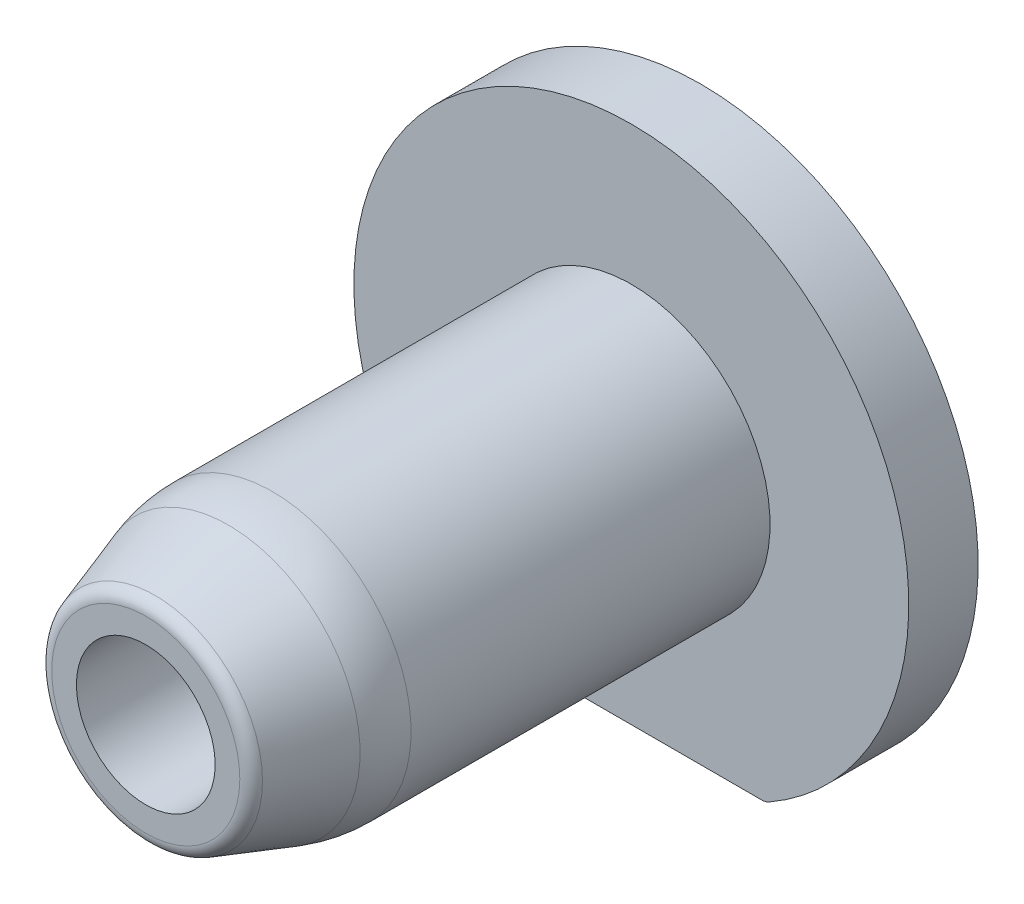
ISO-10303-21;
HEADER;
FILE_DESCRIPTION(('STEP AP214'),'2;1');
FILE_NAME('part.step','',(''),(''),'','','');
FILE_SCHEMA(('AUTOMOTIVE_DESIGN { 1 0 10303 214 1 1 1 1 }'));
ENDSEC;
DATA;
#1=APPLICATION_CONTEXT('core data for automotive mechanical design processes');
#2=APPLICATION_PROTOCOL_DEFINITION('international standard','automotive_design',2000,#1);
#3=PRODUCT_CONTEXT('',#1,'mechanical');
#4=PRODUCT('Part','Part','',(#3));
#5=PRODUCT_RELATED_PRODUCT_CATEGORY('part','',(#4));
#6=PRODUCT_DEFINITION_FORMATION('','',#4);
#7=PRODUCT_DEFINITION_CONTEXT('part definition',#1,'design');
#8=PRODUCT_DEFINITION('design','',#6,#7);
#9=PRODUCT_DEFINITION_SHAPE('','',#8);
#10=(LENGTH_UNIT() NAMED_UNIT(*) SI_UNIT(.MILLI.,.METRE.));
#11=(NAMED_UNIT(*) PLANE_ANGLE_UNIT() SI_UNIT($,.RADIAN.));
#12=(NAMED_UNIT(*) SI_UNIT($,.STERADIAN.) SOLID_ANGLE_UNIT());
#13=UNCERTAINTY_MEASURE_WITH_UNIT(LENGTH_MEASURE(1.E-05),#10,'distance_accuracy_value','');
#14=(GEOMETRIC_REPRESENTATION_CONTEXT(3) GLOBAL_UNCERTAINTY_ASSIGNED_CONTEXT((#13)) GLOBAL_UNIT_ASSIGNED_CONTEXT((#10,
#11,#12)) REPRESENTATION_CONTEXT('',''));
#15=CARTESIAN_POINT('',(0.,0.,0.));
#16=DIRECTION('',(0.,0.,1.));
#17=DIRECTION('',(1.,0.,0.));
#18=AXIS2_PLACEMENT_3D('',#15,#16,#17);
#19=CARTESIAN_POINT('',(0.,0.25,0.));
#20=DIRECTION('',(0.,0.,1.));
#21=DIRECTION('',(1.,0.,0.));
#22=AXIS2_PLACEMENT_3D('',#19,#20,#21);
#23=PLANE('',#22);
#24=CARTESIAN_POINT('',(1.88414436814168,-3.3,0.));
#25=DIRECTION('',(0.,0.,1.));
#26=DIRECTION('',(0.256494588021289,-0.966545666958261,0.));
#27=AXIS2_PLACEMENT_3D('',#24,#25,#26);
#28=CIRCLE('',#27,0.2);
#29=CARTESIAN_POINT('',(1.88414436814168,-3.5,0.));
#30=VERTEX_POINT('',#29);
#31=CARTESIAN_POINT('',(1.98330986120176,-3.47368421052632,0.));
#32=VERTEX_POINT('',#31);
#33=EDGE_CURVE('E124',#30,#32,#28,.T.);
#34=ORIENTED_EDGE('',*,*,#33,.F.);
#35=DIRECTION('',(1.,0.,0.));
#36=VECTOR('',#35,1.);
#37=CARTESIAN_POINT('',(-1.93649167310371,-3.5,0.));
#38=LINE('',#37,#36);
#39=CARTESIAN_POINT('',(-1.88414436814168,-3.5,0.));
#40=VERTEX_POINT('',#39);
#41=EDGE_CURVE('E11',#40,#30,#38,.T.);
#42=ORIENTED_EDGE('',*,*,#41,.F.);
#43=CARTESIAN_POINT('',(-1.88414436814168,-3.3,0.));
#44=DIRECTION('',(0.,0.,1.));
#45=DIRECTION('',(-0.256494588021288,-0.966545666958261,0.));
#46=AXIS2_PLACEMENT_3D('',#43,#44,#45);
#47=CIRCLE('',#46,0.2);
#48=CARTESIAN_POINT('',(-1.98330986120177,-3.47368421052632,0.));
#49=VERTEX_POINT('',#48);
#50=EDGE_CURVE('E87',#49,#40,#47,.T.);
#51=ORIENTED_EDGE('',*,*,#50,.F.);
#52=CARTESIAN_POINT('',(0.,0.,0.));
#53=DIRECTION('',(0.,0.,1.));
#54=DIRECTION('',(1.,0.,0.));
#55=AXIS2_PLACEMENT_3D('',#52,#53,#54);
#56=CIRCLE('',#55,4.);
#57=EDGE_CURVE('E154',#32,#49,#56,.T.);
#58=ORIENTED_EDGE('',*,*,#57,.F.);
#59=EDGE_LOOP('',(#34,#42,#51,#58));
#60=FACE_BOUND('',#59,.T.);
#61=ADVANCED_FACE('F16',(#60),#23,.F.);
#62=CARTESIAN_POINT('',(0.,0.25,1.));
#63=DIRECTION('',(0.,0.,1.));
#64=DIRECTION('',(1.,0.,0.));
#65=AXIS2_PLACEMENT_3D('',#62,#63,#64);
#66=PLANE('',#65);
#67=CARTESIAN_POINT('',(0.,0.,1.));
#68=DIRECTION('',(0.,0.,1.));
#69=DIRECTION('',(1.,0.,0.));
#70=AXIS2_PLACEMENT_3D('',#67,#68,#69);
#71=CIRCLE('',#70,1.);
#72=CARTESIAN_POINT('',(-1.,0.,1.));
#73=VERTEX_POINT('',#72);
#74=EDGE_CURVE('E27',#73,#73,#71,.T.);
#75=ORIENTED_EDGE('',*,*,#74,.T.);
#76=EDGE_LOOP('',(#75));
#77=FACE_BOUND('',#76,.T.);
#78=ADVANCED_FACE('F272',(#77),#66,.T.);
#79=CARTESIAN_POINT('',(-1.93649167310371,-3.5,0.));
#80=DIRECTION('',(0.,-1.,0.));
#81=DIRECTION('',(0.,0.,-1.));
#82=AXIS2_PLACEMENT_3D('',#79,#80,#81);
#83=PLANE('',#82);
#84=DIRECTION('',(0.,0.,-1.));
#85=VECTOR('',#84,1.);
#86=CARTESIAN_POINT('',(1.88414436814168,-3.5,0.));
#87=LINE('',#86,#85);
#88=CARTESIAN_POINT('',(1.88414436814168,-3.5,1.));
#89=VERTEX_POINT('',#88);
#90=EDGE_CURVE('E132',#89,#30,#87,.T.);
#91=ORIENTED_EDGE('',*,*,#90,.F.);
#92=DIRECTION('',(1.,0.,0.));
#93=VECTOR('',#92,1.);
#94=CARTESIAN_POINT('',(-1.93649167310371,-3.5,1.));
#95=LINE('',#94,#93);
#96=CARTESIAN_POINT('',(-1.88414436814168,-3.5,1.));
#97=VERTEX_POINT('',#96);
#98=EDGE_CURVE('E129',#97,#89,#95,.T.);
#99=ORIENTED_EDGE('',*,*,#98,.F.);
#100=DIRECTION('',(0.,0.,1.));
#101=VECTOR('',#100,1.);
#102=CARTESIAN_POINT('',(-1.88414436814168,-3.5,0.));
#103=LINE('',#102,#101);
#104=EDGE_CURVE('E167',#40,#97,#103,.T.);
#105=ORIENTED_EDGE('',*,*,#104,.F.);
#106=ORIENTED_EDGE('',*,*,#41,.T.);
#107=EDGE_LOOP('',(#91,#99,#105,#106));
#108=FACE_BOUND('',#107,.T.);
#109=ADVANCED_FACE('F277',(#108),#83,.T.);
#110=CARTESIAN_POINT('',(0.,0.,0.));
#111=DIRECTION('',(0.,0.,1.));
#112=DIRECTION('',(1.,0.,0.));
#113=AXIS2_PLACEMENT_3D('',#110,#111,#112);
#114=CYLINDRICAL_SURFACE('',#113,1.);
#115=CARTESIAN_POINT('',(0.,0.,8.));
#116=DIRECTION('',(0.,0.,-1.));
#117=DIRECTION('',(1.,0.,0.));
#118=AXIS2_PLACEMENT_3D('',#115,#116,#117);
#119=CIRCLE('',#118,1.);
#120=CARTESIAN_POINT('',(-1.,0.,8.));
#121=VERTEX_POINT('',#120);
#122=EDGE_CURVE('E146',#121,#121,#119,.T.);
#123=ORIENTED_EDGE('',*,*,#122,.F.);
#124=DIRECTION('',(0.,0.,-1.));
#125=VECTOR('',#124,1.);
#126=CARTESIAN_POINT('',(-1.,0.,0.));
#127=LINE('',#126,#125);
#128=EDGE_CURVE('E177',#121,#73,#127,.T.);
#129=ORIENTED_EDGE('',*,*,#128,.T.);
#130=ORIENTED_EDGE('',*,*,#74,.F.);
#131=ORIENTED_EDGE('',*,*,#128,.F.);
#132=EDGE_LOOP('',(#123,#129,#130,#131));
#133=FACE_BOUND('',#132,.T.);
#134=ADVANCED_FACE('F283',(#133),#114,.F.);
#135=CARTESIAN_POINT('',(0.,0.,0.));
#136=DIRECTION('',(0.,0.,1.));
#137=DIRECTION('',(1.,0.,0.));
#138=AXIS2_PLACEMENT_3D('',#135,#136,#137);
#139=CYLINDRICAL_SURFACE('',#138,2.);
#140=CARTESIAN_POINT('',(0.,0.,6.17544467966324));
#141=DIRECTION('',(0.,0.,1.));
#142=DIRECTION('',(1.,0.,0.));
#143=AXIS2_PLACEMENT_3D('',#140,#141,#142);
#144=CIRCLE('',#143,2.);
#145=CARTESIAN_POINT('',(-2.,0.,6.17544467966324));
#146=VERTEX_POINT('',#145);
#147=EDGE_CURVE('E145',#146,#146,#144,.T.);
#148=ORIENTED_EDGE('',*,*,#147,.F.);
#149=DIRECTION('',(0.,0.,-1.));
#150=VECTOR('',#149,1.);
#151=CARTESIAN_POINT('',(-2.,0.,0.));
#152=LINE('',#151,#150);
#153=CARTESIAN_POINT('',(-2.,0.,1.));
#154=VERTEX_POINT('',#153);
#155=EDGE_CURVE('E98',#146,#154,#152,.T.);
#156=ORIENTED_EDGE('',*,*,#155,.T.);
#157=CARTESIAN_POINT('',(0.,0.,1.));
#158=DIRECTION('',(0.,0.,-1.));
#159=DIRECTION('',(1.,0.,0.));
#160=AXIS2_PLACEMENT_3D('',#157,#158,#159);
#161=CIRCLE('',#160,2.);
#162=EDGE_CURVE('E152',#154,#154,#161,.T.);
#163=ORIENTED_EDGE('',*,*,#162,.F.);
#164=ORIENTED_EDGE('',*,*,#155,.F.);
#165=EDGE_LOOP('',(#148,#156,#163,#164));
#166=FACE_BOUND('',#165,.T.);
#167=ADVANCED_FACE('F267',(#166),#139,.T.);
#168=CARTESIAN_POINT('',(0.,0.,6.17544467966324));
#169=DIRECTION('',(0.,0.,1.));
#170=DIRECTION('',(1.,0.,0.));
#171=AXIS2_PLACEMENT_3D('',#168,#169,#170);
#172=SPHERICAL_SURFACE('',#171,2.);
#173=CARTESIAN_POINT('',(0.,0.,6.80790021169692));
#174=DIRECTION('',(0.,0.,-1.));
#175=DIRECTION('',(1.,0.,0.));
#176=AXIS2_PLACEMENT_3D('',#173,#174,#175);
#177=CIRCLE('',#176,1.89736659610103);
#178=CARTESIAN_POINT('',(-1.89736659610103,0.,6.80790021169692));
#179=VERTEX_POINT('',#178);
#180=EDGE_CURVE('E183',#179,#179,#177,.T.);
#181=ORIENTED_EDGE('',*,*,#180,.T.);
#182=CARTESIAN_POINT('',(0.,0.,6.17544467966324));
#183=DIRECTION('',(0.,-1.,0.));
#184=DIRECTION('',(-1.,0.,0.));
#185=AXIS2_PLACEMENT_3D('',#182,#183,#184);
#186=CIRCLE('',#185,2.);
#187=EDGE_CURVE('E141',#179,#146,#186,.T.);
#188=ORIENTED_EDGE('',*,*,#187,.T.);
#189=ORIENTED_EDGE('',*,*,#147,.T.);
#190=ORIENTED_EDGE('',*,*,#187,.F.);
#191=EDGE_LOOP('',(#181,#188,#189,#190));
#192=FACE_BOUND('',#191,.T.);
#193=ADVANCED_FACE('F209',(#192),#172,.T.);
#194=CARTESIAN_POINT('',(0.,0.,8.));
#195=DIRECTION('',(0.,0.,1.));
#196=DIRECTION('',(1.,0.,0.));
#197=AXIS2_PLACEMENT_3D('',#194,#195,#196);
#198=PLANE('',#197);
#199=ORIENTED_EDGE('',*,*,#122,.T.);
#200=EDGE_LOOP('',(#199));
#201=FACE_BOUND('',#200,.T.);
#202=CARTESIAN_POINT('',(0.,0.,8.));
#203=DIRECTION('',(0.,0.,-1.));
#204=DIRECTION('',(1.,0.,0.));
#205=AXIS2_PLACEMENT_3D('',#202,#203,#204);
#206=CIRCLE('',#205,1.35584815598877);
#207=CARTESIAN_POINT('',(1.35584815598877,0.,8.));
#208=VERTEX_POINT('',#207);
#209=EDGE_CURVE('E20',#208,#208,#206,.T.);
#210=ORIENTED_EDGE('',*,*,#209,.F.);
#211=EDGE_LOOP('',(#210));
#212=FACE_BOUND('',#211,.T.);
#213=ADVANCED_FACE('F257',(#201,#212),#198,.T.);
#214=CARTESIAN_POINT('',(0.,0.,7.25));
#215=DIRECTION('',(0.,0.,-1.));
#216=DIRECTION('',(1.,0.,0.));
#217=AXIS2_PLACEMENT_3D('',#214,#215,#216);
#218=CONICAL_SURFACE('',#217,1.75,0.321750554396642);
#219=CARTESIAN_POINT('',(0.,0.,7.86324555320337));
#220=DIRECTION('',(0.,0.,1.));
#221=DIRECTION('',(1.,0.,0.));
#222=AXIS2_PLACEMENT_3D('',#219,#220,#221);
#223=CIRCLE('',#222,1.54558481559888);
#224=CARTESIAN_POINT('',(-1.54558481559888,0.,7.86324555320337));
#225=VERTEX_POINT('',#224);
#226=CARTESIAN_POINT('',(1.54558481559888,0.,7.86324555320337));
#227=VERTEX_POINT('',#226);
#228=EDGE_CURVE('E158',#225,#227,#223,.T.);
#229=ORIENTED_EDGE('',*,*,#228,.F.);
#230=DIRECTION('',(-0.316227766016838,0.,-0.948683298050514));
#231=VECTOR('',#230,1.);
#232=CARTESIAN_POINT('',(-1.75,0.,7.25));
#233=LINE('',#232,#231);
#234=EDGE_CURVE('E188',#225,#179,#233,.T.);
#235=ORIENTED_EDGE('',*,*,#234,.T.);
#236=ORIENTED_EDGE('',*,*,#180,.F.);
#237=ORIENTED_EDGE('',*,*,#234,.F.);
#238=CARTESIAN_POINT('',(0.,0.,7.86324555320337));
#239=DIRECTION('',(0.,0.,1.));
#240=DIRECTION('',(1.,0.,0.));
#241=AXIS2_PLACEMENT_3D('',#238,#239,#240);
#242=CIRCLE('',#241,1.54558481559888);
#243=EDGE_CURVE('E166',#227,#225,#242,.T.);
#244=ORIENTED_EDGE('',*,*,#243,.F.);
#245=EDGE_LOOP('',(#229,#235,#236,#237,#244));
#246=FACE_BOUND('',#245,.T.);
#247=ADVANCED_FACE('F212',(#246),#218,.T.);
#248=CARTESIAN_POINT('',(0.,0.,7.8));
#249=DIRECTION('',(0.,0.,-1.));
#250=DIRECTION('',(-1.,0.,0.));
#251=AXIS2_PLACEMENT_3D('',#248,#249,#250);
#252=TOROIDAL_SURFACE('',#251,1.35584815598877,0.2);
#253=ORIENTED_EDGE('',*,*,#228,.T.);
#254=CARTESIAN_POINT('',(1.35584815598877,0.,7.8));
#255=DIRECTION('',(0.,-1.,0.));
#256=DIRECTION('',(1.,0.,0.));
#257=AXIS2_PLACEMENT_3D('',#254,#255,#256);
#258=CIRCLE('',#257,0.2);
#259=EDGE_CURVE('E155',#227,#208,#258,.T.);
#260=ORIENTED_EDGE('',*,*,#259,.T.);
#261=ORIENTED_EDGE('',*,*,#209,.T.);
#262=ORIENTED_EDGE('',*,*,#259,.F.);
#263=ORIENTED_EDGE('',*,*,#243,.T.);
#264=EDGE_LOOP('',(#253,#260,#261,#262,#263));
#265=FACE_BOUND('',#264,.T.);
#266=ADVANCED_FACE('F254',(#265),#252,.T.);
#267=CARTESIAN_POINT('',(-1.88414436814168,-3.3,0.));
#268=DIRECTION('',(0.,0.,1.));
#269=DIRECTION('',(-0.256494588021288,-0.966545666958261,0.));
#270=AXIS2_PLACEMENT_3D('',#267,#268,#269);
#271=CYLINDRICAL_SURFACE('',#270,0.2);
#272=CARTESIAN_POINT('',(-1.88414436814168,-3.3,1.));
#273=DIRECTION('',(0.,0.,-1.));
#274=DIRECTION('',(-0.256494588021288,-0.966545666958261,0.));
#275=AXIS2_PLACEMENT_3D('',#272,#273,#274);
#276=CIRCLE('',#275,0.2);
#277=CARTESIAN_POINT('',(-1.98330986120177,-3.47368421052632,1.));
#278=VERTEX_POINT('',#277);
#279=EDGE_CURVE('E117',#97,#278,#276,.T.);
#280=ORIENTED_EDGE('',*,*,#279,.T.);
#281=DIRECTION('',(0.,0.,-1.));
#282=VECTOR('',#281,1.);
#283=CARTESIAN_POINT('',(-1.98330986120177,-3.47368421052632,0.));
#284=LINE('',#283,#282);
#285=EDGE_CURVE('E111',#278,#49,#284,.T.);
#286=ORIENTED_EDGE('',*,*,#285,.T.);
#287=ORIENTED_EDGE('',*,*,#50,.T.);
#288=ORIENTED_EDGE('',*,*,#104,.T.);
#289=EDGE_LOOP('',(#280,#286,#287,#288));
#290=FACE_BOUND('',#289,.T.);
#291=ADVANCED_FACE('F282',(#290),#271,.T.);
#292=CARTESIAN_POINT('',(0.,0.,0.));
#293=DIRECTION('',(0.,0.,1.));
#294=DIRECTION('',(0.,1.,0.));
#295=AXIS2_PLACEMENT_3D('',#292,#293,#294);
#296=CYLINDRICAL_SURFACE('',#295,4.);
#297=DIRECTION('',(0.,0.,1.));
#298=VECTOR('',#297,1.);
#299=CARTESIAN_POINT('',(1.98330986120177,-3.47368421052632,0.));
#300=LINE('',#299,#298);
#301=CARTESIAN_POINT('',(1.98330986120176,-3.47368421052632,1.));
#302=VERTEX_POINT('',#301);
#303=EDGE_CURVE('E109',#32,#302,#300,.T.);
#304=ORIENTED_EDGE('',*,*,#303,.F.);
#305=ORIENTED_EDGE('',*,*,#57,.T.);
#306=ORIENTED_EDGE('',*,*,#285,.F.);
#307=CARTESIAN_POINT('',(0.,0.,1.));
#308=DIRECTION('',(0.,0.,1.));
#309=DIRECTION('',(1.,0.,0.));
#310=AXIS2_PLACEMENT_3D('',#307,#308,#309);
#311=CIRCLE('',#310,4.);
#312=EDGE_CURVE('E105',#302,#278,#311,.T.);
#313=ORIENTED_EDGE('',*,*,#312,.F.);
#314=EDGE_LOOP('',(#304,#305,#306,#313));
#315=FACE_BOUND('',#314,.T.);
#316=ADVANCED_FACE('F107',(#315),#296,.T.);
#317=CARTESIAN_POINT('',(0.,0.25,1.));
#318=DIRECTION('',(0.,0.,1.));
#319=DIRECTION('',(1.,0.,0.));
#320=AXIS2_PLACEMENT_3D('',#317,#318,#319);
#321=PLANE('',#320);
#322=ORIENTED_EDGE('',*,*,#162,.T.);
#323=EDGE_LOOP('',(#322));
#324=FACE_BOUND('',#323,.T.);
#325=CARTESIAN_POINT('',(1.88414436814168,-3.3,1.));
#326=DIRECTION('',(0.,0.,-1.));
#327=DIRECTION('',(0.256494588021289,-0.966545666958261,0.));
#328=AXIS2_PLACEMENT_3D('',#325,#326,#327);
#329=CIRCLE('',#328,0.2);
#330=EDGE_CURVE('E122',#302,#89,#329,.T.);
#331=ORIENTED_EDGE('',*,*,#330,.F.);
#332=ORIENTED_EDGE('',*,*,#312,.T.);
#333=ORIENTED_EDGE('',*,*,#279,.F.);
#334=ORIENTED_EDGE('',*,*,#98,.T.);
#335=EDGE_LOOP('',(#331,#332,#333,#334));
#336=FACE_BOUND('',#335,.T.);
#337=ADVANCED_FACE('F127',(#324,#336),#321,.T.);
#338=CARTESIAN_POINT('',(1.88414436814168,-3.3,0.));
#339=DIRECTION('',(0.,0.,1.));
#340=DIRECTION('',(0.256494588021289,-0.966545666958261,0.));
#341=AXIS2_PLACEMENT_3D('',#338,#339,#340);
#342=CYLINDRICAL_SURFACE('',#341,0.2);
#343=ORIENTED_EDGE('',*,*,#330,.T.);
#344=ORIENTED_EDGE('',*,*,#90,.T.);
#345=ORIENTED_EDGE('',*,*,#33,.T.);
#346=ORIENTED_EDGE('',*,*,#303,.T.);
#347=EDGE_LOOP('',(#343,#344,#345,#346));
#348=FACE_BOUND('',#347,.T.);
#349=ADVANCED_FACE('F18',(#348),#342,.T.);
#350=CLOSED_SHELL('',(#61,#78,#109,#134,#167,#193,#213,#247,#266,#291,#316,#337,#349));
#351=MANIFOLD_SOLID_BREP('B1',#350);
#352=ADVANCED_BREP_SHAPE_REPRESENTATION('',(#18,#351),#14);
#353=SHAPE_DEFINITION_REPRESENTATION(#9,#352);
ENDSEC;
END-ISO-10303-21;
